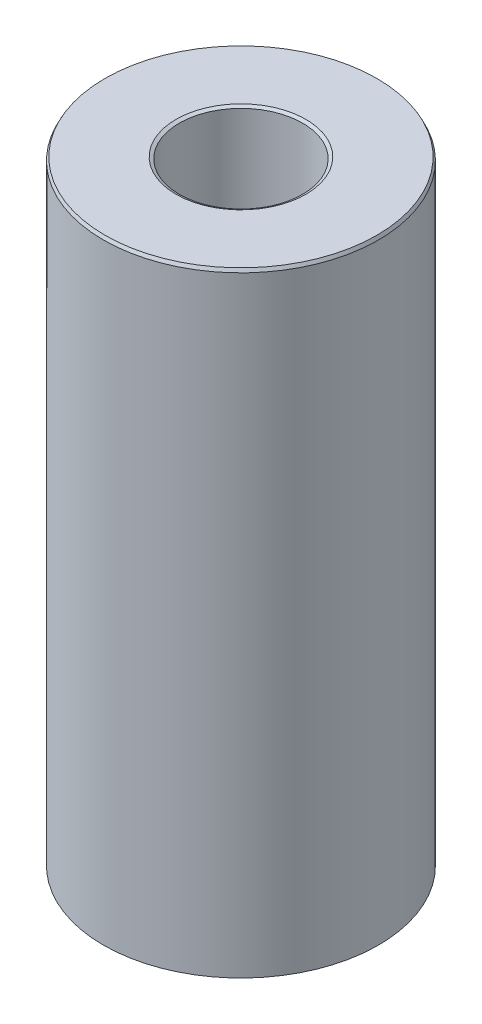
ISO-10303-21;
HEADER;
FILE_DESCRIPTION(('STEP AP214'),'2;1');
FILE_NAME('part.step','',(''),(''),'','','');
FILE_SCHEMA(('AUTOMOTIVE_DESIGN { 1 0 10303 214 1 1 1 1 }'));
ENDSEC;
DATA;
#1=APPLICATION_CONTEXT('core data for automotive mechanical design processes');
#2=APPLICATION_PROTOCOL_DEFINITION('international standard','automotive_design',2000,#1);
#3=PRODUCT_CONTEXT('',#1,'mechanical');
#4=PRODUCT('Part','Part','',(#3));
#5=PRODUCT_RELATED_PRODUCT_CATEGORY('part','',(#4));
#6=PRODUCT_DEFINITION_FORMATION('','',#4);
#7=PRODUCT_DEFINITION_CONTEXT('part definition',#1,'design');
#8=PRODUCT_DEFINITION('design','',#6,#7);
#9=PRODUCT_DEFINITION_SHAPE('','',#8);
#10=(LENGTH_UNIT() NAMED_UNIT(*) SI_UNIT(.MILLI.,.METRE.));
#11=(NAMED_UNIT(*) PLANE_ANGLE_UNIT() SI_UNIT($,.RADIAN.));
#12=(NAMED_UNIT(*) SI_UNIT($,.STERADIAN.) SOLID_ANGLE_UNIT());
#13=UNCERTAINTY_MEASURE_WITH_UNIT(LENGTH_MEASURE(1.E-05),#10,'distance_accuracy_value','');
#14=(GEOMETRIC_REPRESENTATION_CONTEXT(3) GLOBAL_UNCERTAINTY_ASSIGNED_CONTEXT((#13)) GLOBAL_UNIT_ASSIGNED_CONTEXT((#10,
#11,#12)) REPRESENTATION_CONTEXT('',''));
#15=CARTESIAN_POINT('',(0.,0.,0.));
#16=DIRECTION('',(0.,0.,1.));
#17=DIRECTION('',(1.,0.,0.));
#18=AXIS2_PLACEMENT_3D('',#15,#16,#17);
#19=CARTESIAN_POINT('',(0.,55.9550324871579,0.));
#20=DIRECTION('',(0.,-1.,0.));
#21=DIRECTION('',(0.,0.,-1.));
#22=AXIS2_PLACEMENT_3D('',#19,#20,#21);
#23=CYLINDRICAL_SURFACE('',#22,12.5);
#24=CARTESIAN_POINT('',(0.,0.147431192739439,0.));
#25=DIRECTION('',(0.,1.,0.));
#26=DIRECTION('',(0.,0.,1.));
#27=AXIS2_PLACEMENT_3D('',#24,#25,#26);
#28=CIRCLE('',#27,12.5);
#29=CARTESIAN_POINT('',(0.,0.147431192739439,12.5));
#30=VERTEX_POINT('',#29);
#31=EDGE_CURVE('E10',#30,#30,#28,.T.);
#32=ORIENTED_EDGE('',*,*,#31,.T.);
#33=EDGE_LOOP('',(#32));
#34=FACE_BOUND('',#33,.T.);
#35=CARTESIAN_POINT('',(0.,55.6597461702373,0.));
#36=DIRECTION('',(0.,1.,0.));
#37=DIRECTION('',(0.,0.,1.));
#38=AXIS2_PLACEMENT_3D('',#35,#36,#37);
#39=CIRCLE('',#38,12.5);
#40=CARTESIAN_POINT('',(0.,55.6597461702373,12.5));
#41=VERTEX_POINT('',#40);
#42=EDGE_CURVE('E50',#41,#41,#39,.F.);
#43=ORIENTED_EDGE('',*,*,#42,.T.);
#44=EDGE_LOOP('',(#43));
#45=FACE_BOUND('',#44,.T.);
#46=ADVANCED_FACE('F39',(#34,#45),#23,.T.);
#47=CARTESIAN_POINT('',(0.,55.9550324871579,0.));
#48=DIRECTION('',(0.,1.,0.));
#49=DIRECTION('',(0.,0.,1.));
#50=AXIS2_PLACEMENT_3D('',#47,#48,#49);
#51=PLANE('',#50);
#52=CARTESIAN_POINT('',(0.,55.9550324871579,0.));
#53=DIRECTION('',(0.,1.,0.));
#54=DIRECTION('',(0.,0.,1.));
#55=AXIS2_PLACEMENT_3D('',#52,#53,#54);
#56=CIRCLE('',#55,5.90264951676316);
#57=CARTESIAN_POINT('',(0.,55.9550324871579,5.90264951676316));
#58=VERTEX_POINT('',#57);
#59=EDGE_CURVE('E58',#58,#58,#56,.F.);
#60=ORIENTED_EDGE('',*,*,#59,.T.);
#61=EDGE_LOOP('',(#60));
#62=FACE_BOUND('',#61,.T.);
#63=CARTESIAN_POINT('',(0.,55.9550324871579,0.));
#64=DIRECTION('',(0.,1.,0.));
#65=DIRECTION('',(0.,0.,1.));
#66=AXIS2_PLACEMENT_3D('',#63,#64,#65);
#67=CIRCLE('',#66,12.3525688072606);
#68=CARTESIAN_POINT('',(0.,55.9550324871579,12.3525688072606));
#69=VERTEX_POINT('',#68);
#70=EDGE_CURVE('E61',#69,#69,#67,.T.);
#71=ORIENTED_EDGE('',*,*,#70,.T.);
#72=EDGE_LOOP('',(#71));
#73=FACE_BOUND('',#72,.T.);
#74=ADVANCED_FACE('F88',(#62,#73),#51,.T.);
#75=CARTESIAN_POINT('',(0.,0.,0.));
#76=DIRECTION('',(0.,1.,0.));
#77=DIRECTION('',(0.,0.,1.));
#78=AXIS2_PLACEMENT_3D('',#75,#76,#77);
#79=PLANE('',#78);
#80=CARTESIAN_POINT('',(0.,0.,0.));
#81=DIRECTION('',(0.,1.,0.));
#82=DIRECTION('',(0.,0.,1.));
#83=AXIS2_PLACEMENT_3D('',#80,#81,#82);
#84=CIRCLE('',#83,5.75479439258197);
#85=CARTESIAN_POINT('',(0.,0.,5.75479439258197));
#86=VERTEX_POINT('',#85);
#87=EDGE_CURVE('E51',#86,#86,#84,.T.);
#88=ORIENTED_EDGE('',*,*,#87,.T.);
#89=EDGE_LOOP('',(#88));
#90=FACE_BOUND('',#89,.T.);
#91=CARTESIAN_POINT('',(0.,0.,0.));
#92=DIRECTION('',(0.,1.,0.));
#93=DIRECTION('',(0.,0.,1.));
#94=AXIS2_PLACEMENT_3D('',#91,#92,#93);
#95=CIRCLE('',#94,12.2047136830794);
#96=CARTESIAN_POINT('',(0.,0.,12.2047136830794));
#97=VERTEX_POINT('',#96);
#98=EDGE_CURVE('E54',#97,#97,#95,.F.);
#99=ORIENTED_EDGE('',*,*,#98,.T.);
#100=EDGE_LOOP('',(#99));
#101=FACE_BOUND('',#100,.T.);
#102=ADVANCED_FACE('F83',(#90,#101),#79,.F.);
#103=CARTESIAN_POINT('',(0.,55.9550324871579,0.));
#104=DIRECTION('',(0.,-1.,0.));
#105=DIRECTION('',(0.,0.,-1.));
#106=AXIS2_PLACEMENT_3D('',#103,#104,#105);
#107=CYLINDRICAL_SURFACE('',#106,5.60736319984253);
#108=CARTESIAN_POINT('',(0.,55.8076012944184,0.));
#109=DIRECTION('',(0.,1.,0.));
#110=DIRECTION('',(0.,0.,1.));
#111=AXIS2_PLACEMENT_3D('',#108,#109,#110);
#112=CIRCLE('',#111,5.60736319984253);
#113=CARTESIAN_POINT('',(0.,55.8076012944184,5.60736319984253));
#114=VERTEX_POINT('',#113);
#115=EDGE_CURVE('E67',#114,#114,#112,.T.);
#116=ORIENTED_EDGE('',*,*,#115,.T.);
#117=EDGE_LOOP('',(#116));
#118=FACE_BOUND('',#117,.T.);
#119=CARTESIAN_POINT('',(0.,0.295286316920627,0.));
#120=DIRECTION('',(0.,1.,0.));
#121=DIRECTION('',(0.,0.,1.));
#122=AXIS2_PLACEMENT_3D('',#119,#120,#121);
#123=CIRCLE('',#122,5.60736319984253);
#124=CARTESIAN_POINT('',(0.,0.295286316920627,5.60736319984253));
#125=VERTEX_POINT('',#124);
#126=EDGE_CURVE('E69',#125,#125,#123,.F.);
#127=ORIENTED_EDGE('',*,*,#126,.T.);
#128=EDGE_LOOP('',(#127));
#129=FACE_BOUND('',#128,.T.);
#130=ADVANCED_FACE('F71',(#118,#129),#107,.F.);
#131=CARTESIAN_POINT('',(0.,55.8076012944184,0.));
#132=DIRECTION('',(0.,1.,0.));
#133=DIRECTION('',(0.,0.,1.));
#134=AXIS2_PLACEMENT_3D('',#131,#132,#133);
#135=CONICAL_SURFACE('',#134,5.60736319984253,1.10772314760033);
#136=CARTESIAN_POINT('',(0.,55.9550324871579,5.90264951676316));
#137=CARTESIAN_POINT('',(0.,55.9534967455669,5.89957361762857));
#138=CARTESIAN_POINT('',(0.,55.9519610039758,5.89649771849398));
#139=CARTESIAN_POINT('',(0.,55.9488895207937,5.8903459202248));
#140=CARTESIAN_POINT('',(0.,55.9473537792027,5.88727002109021));
#141=CARTESIAN_POINT('',(0.,55.9442822960206,5.88111822282103));
#142=CARTESIAN_POINT('',(0.,55.9427465544296,5.87804232368644));
#143=CARTESIAN_POINT('',(0.,55.9396750712475,5.87189052541726));
#144=CARTESIAN_POINT('',(0.,55.9381393296565,5.86881462628267));
#145=CARTESIAN_POINT('',(0.,55.9350678464744,5.86266282801349));
#146=CARTESIAN_POINT('',(0.,55.9335321048834,5.8595869288789));
#147=CARTESIAN_POINT('',(0.,55.9304606217013,5.85343513060972));
#148=CARTESIAN_POINT('',(0.,55.9289248801103,5.85035923147513));
#149=CARTESIAN_POINT('',(0.,55.9258533969282,5.84420743320595));
#150=CARTESIAN_POINT('',(0.,55.9243176553372,5.84113153407136));
#151=CARTESIAN_POINT('',(0.,55.9212461721551,5.83497973580218));
#152=CARTESIAN_POINT('',(0.,55.9197104305641,5.83190383666759));
#153=CARTESIAN_POINT('',(0.,55.916638947382,5.82575203839841));
#154=CARTESIAN_POINT('',(0.,55.915103205791,5.82267613926382));
#155=CARTESIAN_POINT('',(0.,55.9120317226089,5.81652434099464));
#156=CARTESIAN_POINT('',(0.,55.9104959810178,5.81344844186005));
#157=CARTESIAN_POINT('',(0.,55.9074244978358,5.80729664359087));
#158=CARTESIAN_POINT('',(0.,55.9058887562447,5.80422074445628));
#159=CARTESIAN_POINT('',(0.,55.9028172730627,5.7980689461871));
#160=CARTESIAN_POINT('',(0.,55.9012815314716,5.79499304705251));
#161=CARTESIAN_POINT('',(0.,55.8982100482896,5.78884124878333));
#162=CARTESIAN_POINT('',(0.,55.8966743066985,5.78576534964874));
#163=CARTESIAN_POINT('',(0.,55.8936028235165,5.77961355137956));
#164=CARTESIAN_POINT('',(0.,55.8920670819254,5.77653765224497));
#165=CARTESIAN_POINT('',(0.,55.8889955987433,5.77038585397579));
#166=CARTESIAN_POINT('',(0.,55.8874598571523,5.7673099548412));
#167=CARTESIAN_POINT('',(0.,55.8843883739702,5.76115815657202));
#168=CARTESIAN_POINT('',(0.,55.8828526323792,5.75808225743743));
#169=CARTESIAN_POINT('',(0.,55.8797811491971,5.75193045916825));
#170=CARTESIAN_POINT('',(0.,55.8782454076061,5.74885456003366));
#171=CARTESIAN_POINT('',(0.,55.875173924424,5.74270276176448));
#172=CARTESIAN_POINT('',(0.,55.873638182833,5.73962686262989));
#173=CARTESIAN_POINT('',(0.,55.8705666996509,5.73347506436071));
#174=CARTESIAN_POINT('',(0.,55.8690309580599,5.73039916522612));
#175=CARTESIAN_POINT('',(0.,55.8659594748778,5.72424736695694));
#176=CARTESIAN_POINT('',(0.,55.8644237332868,5.72117146782235));
#177=CARTESIAN_POINT('',(0.,55.8613522501047,5.71501966955317));
#178=CARTESIAN_POINT('',(0.,55.8598165085137,5.71194377041858));
#179=CARTESIAN_POINT('',(0.,55.8567450253316,5.7057919721494));
#180=CARTESIAN_POINT('',(0.,55.8552092837406,5.70271607301481));
#181=CARTESIAN_POINT('',(0.,55.8521378005585,5.69656427474563));
#182=CARTESIAN_POINT('',(0.,55.8506020589674,5.69348837561104));
#183=CARTESIAN_POINT('',(0.,55.8475305757854,5.68733657734186));
#184=CARTESIAN_POINT('',(0.,55.8459948341943,5.68426067820727));
#185=CARTESIAN_POINT('',(0.,55.8429233510123,5.67810887993809));
#186=CARTESIAN_POINT('',(0.,55.8413876094212,5.6750329808035));
#187=CARTESIAN_POINT('',(0.,55.8383161262392,5.66888118253432));
#188=CARTESIAN_POINT('',(0.,55.8367803846481,5.66580528339974));
#189=CARTESIAN_POINT('',(0.,55.8337089014661,5.65965348513055));
#190=CARTESIAN_POINT('',(0.,55.832173159875,5.65657758599597));
#191=CARTESIAN_POINT('',(0.,55.8291016766929,5.65042578772678));
#192=CARTESIAN_POINT('',(0.,55.8275659351019,5.64734988859219));
#193=CARTESIAN_POINT('',(0.,55.8244944519198,5.64119809032302));
#194=CARTESIAN_POINT('',(0.,55.8229587103288,5.63812219118843));
#195=CARTESIAN_POINT('',(0.,55.8198872271467,5.63197039291925));
#196=CARTESIAN_POINT('',(0.,55.8183514855557,5.62889449378466));
#197=CARTESIAN_POINT('',(0.,55.8152800023736,5.62274269551548));
#198=CARTESIAN_POINT('',(0.,55.8137442607826,5.61966679638089));
#199=CARTESIAN_POINT('',(0.,55.8106727776005,5.61351499811171));
#200=CARTESIAN_POINT('',(0.,55.8091370360095,5.61043909897712));
#201=CARTESIAN_POINT('',(0.,55.8076012944184,5.60736319984253));
#202=B_SPLINE_CURVE_WITH_KNOTS('',3,(#136,#137,#138,#139,#140,#141,#142,#143,#144,#145,#146,
#147,#148,#149,#150,#151,#152,#153,#154,#155,#156,#157,#158,#159,#160,#161,#162,#163,#164,#165,
#166,#167,#168,#169,#170,#171,#172,#173,#174,#175,#176,#177,#178,#179,#180,#181,#182,#183,#184,
#185,#186,#187,#188,#189,#190,#191,#192,#193,#194,#195,#196,#197,#198,#199,#200,#201),
.UNSPECIFIED.,.F.,.F.,(4,2,2,2,2,2,2,2,2,2,2,2,2,2,2,2,2,2,2,2,2,2,2,2,2,2,2,2,2,2,2,2,4),(0.,
0.0103139187259514,0.0206278374518997,0.0309417561778473,0.0412556749037956,0.0515695936297439,
0.0618835123556923,0.0721974310816437,0.0825113498075912,0.0928252685335396,0.103139187259488,
0.113453105985436,0.123767024711385,0.134080943437336,0.144394862163284,0.154708780889232,
0.16502269961518,0.175336618341128,0.185650537067077,0.195964455793024,0.206278374518976,
0.216592293244924,0.226906211970872,0.237220130696821,0.247534049422768,0.257847968148717,
0.268161886874668,0.278475805600616,0.288789724326565,0.299103643052513,0.30941756177846,
0.319731480504409,0.330045399230357),.UNSPECIFIED.);
#203=EDGE_CURVE('BSEAM77',#58,#114,#202,.T.);
#204=ORIENTED_EDGE('',*,*,#59,.F.);
#205=ORIENTED_EDGE('',*,*,#115,.F.);
#206=ORIENTED_EDGE('',*,*,#203,.T.);
#207=ORIENTED_EDGE('',*,*,#203,.F.);
#208=EDGE_LOOP('',(#204,#206,#205,#207));
#209=FACE_BOUND('',#208,.T.);
#210=ADVANCED_FACE('F77',(#209),#135,.F.);
#211=CARTESIAN_POINT('',(0.,0.,0.));
#212=DIRECTION('',(0.,-1.,0.));
#213=DIRECTION('',(0.,0.,-1.));
#214=AXIS2_PLACEMENT_3D('',#211,#212,#213);
#215=CONICAL_SURFACE('',#214,5.75479439258197,0.463073179194542);
#216=ORIENTED_EDGE('',*,*,#126,.F.);
#217=EDGE_LOOP('',(#216));
#218=FACE_BOUND('',#217,.T.);
#219=ORIENTED_EDGE('',*,*,#87,.F.);
#220=EDGE_LOOP('',(#219));
#221=FACE_BOUND('',#220,.T.);
#222=ADVANCED_FACE('F73',(#218,#221),#215,.F.);
#223=CARTESIAN_POINT('',(0.,0.147431192739439,0.));
#224=DIRECTION('',(0.,1.,0.));
#225=DIRECTION('',(0.,0.,1.));
#226=AXIS2_PLACEMENT_3D('',#223,#224,#225);
#227=CONICAL_SURFACE('',#226,12.5,1.10772314760037);
#228=CARTESIAN_POINT('',(0.,0.,12.2047136830794));
#229=CARTESIAN_POINT('',(0.,0.00153574159103547,12.2077895822139));
#230=CARTESIAN_POINT('',(0.,0.0030714831820714,12.2108654813485));
#231=CARTESIAN_POINT('',(0.,0.00614296636414325,12.2170172796177));
#232=CARTESIAN_POINT('',(0.,0.00767870795517918,12.2200931787523));
#233=CARTESIAN_POINT('',(0.,0.0107501911372509,12.2262449770215));
#234=CARTESIAN_POINT('',(0.,0.0122859327282866,12.2293208761561));
#235=CARTESIAN_POINT('',(0.,0.0153574159103581,12.2354726744253));
#236=CARTESIAN_POINT('',(0.,0.0168931575013939,12.2385485735598));
#237=CARTESIAN_POINT('',(0.,0.0199646406834656,12.244700371829));
#238=CARTESIAN_POINT('',(0.,0.0215003822745016,12.2477762709636));
#239=CARTESIAN_POINT('',(0.,0.0245718654565733,12.2539280692328));
#240=CARTESIAN_POINT('',(0.,0.026107607047609,12.2570039683674));
#241=CARTESIAN_POINT('',(0.,0.0291790902296805,12.2631557666366));
#242=CARTESIAN_POINT('',(0.,0.0307148318207163,12.2662316657712));
#243=CARTESIAN_POINT('',(0.,0.033786315002788,12.2723834640403));
#244=CARTESIAN_POINT('',(0.,0.035322056593824,12.2754593631749));
#245=CARTESIAN_POINT('',(0.,0.0383935397758957,12.2816111614441));
#246=CARTESIAN_POINT('',(0.,0.0399292813669314,12.2846870605787));
#247=CARTESIAN_POINT('',(0.,0.0430007645490029,12.2908388588479));
#248=CARTESIAN_POINT('',(0.,0.0445365061400387,12.2939147579825));
#249=CARTESIAN_POINT('',(0.,0.0476079893221104,12.3000665562516));
#250=CARTESIAN_POINT('',(0.,0.0491437309131464,12.3031424553862));
#251=CARTESIAN_POINT('',(0.,0.0522152140952181,12.3092942536554));
#252=CARTESIAN_POINT('',(0.,0.0537509556862538,12.31237015279));
#253=CARTESIAN_POINT('',(0.,0.0568224388683254,12.3185219510592));
#254=CARTESIAN_POINT('',(0.,0.0583581804593613,12.3215978501938));
#255=CARTESIAN_POINT('',(0.,0.0614296636414328,12.327749648463));
#256=CARTESIAN_POINT('',(0.,0.0629654052324685,12.3308255475975));
#257=CARTESIAN_POINT('',(0.,0.0660368884145403,12.3369773458667));
#258=CARTESIAN_POINT('',(0.,0.0675726300055762,12.3400532450013));
#259=CARTESIAN_POINT('',(0.,0.070644113187648,12.3462050432705));
#260=CARTESIAN_POINT('',(0.,0.0721798547786837,12.3492809424051));
#261=CARTESIAN_POINT('',(0.,0.0752513379607552,12.3554327406743));
#262=CARTESIAN_POINT('',(0.,0.0767870795517909,12.3585086398089));
#263=CARTESIAN_POINT('',(0.,0.0798585627338627,12.364660438078));
#264=CARTESIAN_POINT('',(0.,0.0813943043248986,12.3677363372126));
#265=CARTESIAN_POINT('',(0.,0.0844657875069704,12.3738881354818));
#266=CARTESIAN_POINT('',(0.,0.0860015290980061,12.3769640346164));
#267=CARTESIAN_POINT('',(0.,0.0890730122800776,12.3831158328856));
#268=CARTESIAN_POINT('',(0.,0.0906087538711133,12.3861917320202));
#269=CARTESIAN_POINT('',(0.,0.0936802370531851,12.3923435302893));
#270=CARTESIAN_POINT('',(0.,0.095215978644221,12.3954194294239));
#271=CARTESIAN_POINT('',(0.,0.0982874618262928,12.4015712276931));
#272=CARTESIAN_POINT('',(0.,0.0998232034173285,12.4046471268277));
#273=CARTESIAN_POINT('',(0.,0.1028946865994,12.4107989250969));
#274=CARTESIAN_POINT('',(0.,0.104430428190436,12.4138748242315));
#275=CARTESIAN_POINT('',(0.,0.107501911372507,12.4200266225007));
#276=CARTESIAN_POINT('',(0.,0.109037652963543,12.4231025216352));
#277=CARTESIAN_POINT('',(0.,0.112109136145615,12.4292543199044));
#278=CARTESIAN_POINT('',(0.,0.113644877736651,12.432330219039));
#279=CARTESIAN_POINT('',(0.,0.116716360918722,12.4384820173082));
#280=CARTESIAN_POINT('',(0.,0.118252102509758,12.4415579164428));
#281=CARTESIAN_POINT('',(0.,0.12132358569183,12.447709714712));
#282=CARTESIAN_POINT('',(0.,0.122859327282866,12.4507856138466));
#283=CARTESIAN_POINT('',(0.,0.125930810464937,12.4569374121157));
#284=CARTESIAN_POINT('',(0.,0.127466552055973,12.4600133112503));
#285=CARTESIAN_POINT('',(0.,0.130538035238045,12.4661651095195));
#286=CARTESIAN_POINT('',(0.,0.132073776829081,12.4692410086541));
#287=CARTESIAN_POINT('',(0.,0.135145260011152,12.4753928069233));
#288=CARTESIAN_POINT('',(0.,0.136681001602188,12.4784687060579));
#289=CARTESIAN_POINT('',(0.,0.13975248478426,12.4846205043271));
#290=CARTESIAN_POINT('',(0.,0.141288226375296,12.4876964034616));
#291=CARTESIAN_POINT('',(0.,0.144359709557367,12.4938482017308));
#292=CARTESIAN_POINT('',(0.,0.145895451148403,12.4969241008654));
#293=CARTESIAN_POINT('',(0.,0.147431192739439,12.5));
#294=B_SPLINE_CURVE_WITH_KNOTS('',3,(#228,#229,#230,#231,#232,#233,#234,#235,#236,#237,#238,
#239,#240,#241,#242,#243,#244,#245,#246,#247,#248,#249,#250,#251,#252,#253,#254,#255,#256,#257,
#258,#259,#260,#261,#262,#263,#264,#265,#266,#267,#268,#269,#270,#271,#272,#273,#274,#275,#276,
#277,#278,#279,#280,#281,#282,#283,#284,#285,#286,#287,#288,#289,#290,#291,#292,#293),
.UNSPECIFIED.,.F.,.F.,(4,2,2,2,2,2,2,2,2,2,2,2,2,2,2,2,2,2,2,2,2,2,2,2,2,2,2,2,2,2,2,2,4),(0.,
0.0103139187259495,0.0206278374518974,0.0309417561778469,0.0412556749037964,0.0515695936297443,
0.0618835123556938,0.0721974310816433,0.0825113498075912,0.0928252685335407,0.10313918725949,
0.113453105985438,0.123767024711388,0.134080943437337,0.144394862163287,0.154708780889235,
0.165022699615184,0.175336618341133,0.185650537067081,0.195964455793031,0.20627837451898,
0.216592293244928,0.226906211970878,0.237220130696827,0.247534049422775,0.257847968148725,
0.268161886874674,0.278475805600624,0.288789724326572,0.299103643052521,0.309417561778471,
0.319731480504419,0.330045399230368),.UNSPECIFIED.);
#295=EDGE_CURVE('BSEAM76',#97,#30,#294,.T.);
#296=ORIENTED_EDGE('',*,*,#98,.F.);
#297=ORIENTED_EDGE('',*,*,#31,.F.);
#298=ORIENTED_EDGE('',*,*,#295,.T.);
#299=ORIENTED_EDGE('',*,*,#295,.F.);
#300=EDGE_LOOP('',(#296,#298,#297,#299));
#301=FACE_BOUND('',#300,.T.);
#302=ADVANCED_FACE('F76',(#301),#227,.T.);
#303=CARTESIAN_POINT('',(0.,55.9550324871579,0.));
#304=DIRECTION('',(0.,-1.,0.));
#305=DIRECTION('',(0.,0.,-1.));
#306=AXIS2_PLACEMENT_3D('',#303,#304,#305);
#307=CONICAL_SURFACE('',#306,12.3525688072606,0.463073179194556);
#308=ORIENTED_EDGE('',*,*,#42,.F.);
#309=EDGE_LOOP('',(#308));
#310=FACE_BOUND('',#309,.T.);
#311=ORIENTED_EDGE('',*,*,#70,.F.);
#312=EDGE_LOOP('',(#311));
#313=FACE_BOUND('',#312,.T.);
#314=ADVANCED_FACE('F45',(#310,#313),#307,.T.);
#315=CLOSED_SHELL('',(#46,#74,#102,#130,#210,#222,#302,#314));
#316=MANIFOLD_SOLID_BREP('B2',#315);
#317=ADVANCED_BREP_SHAPE_REPRESENTATION('',(#18,#316),#14);
#318=SHAPE_DEFINITION_REPRESENTATION(#9,#317);
ENDSEC;
END-ISO-10303-21;
